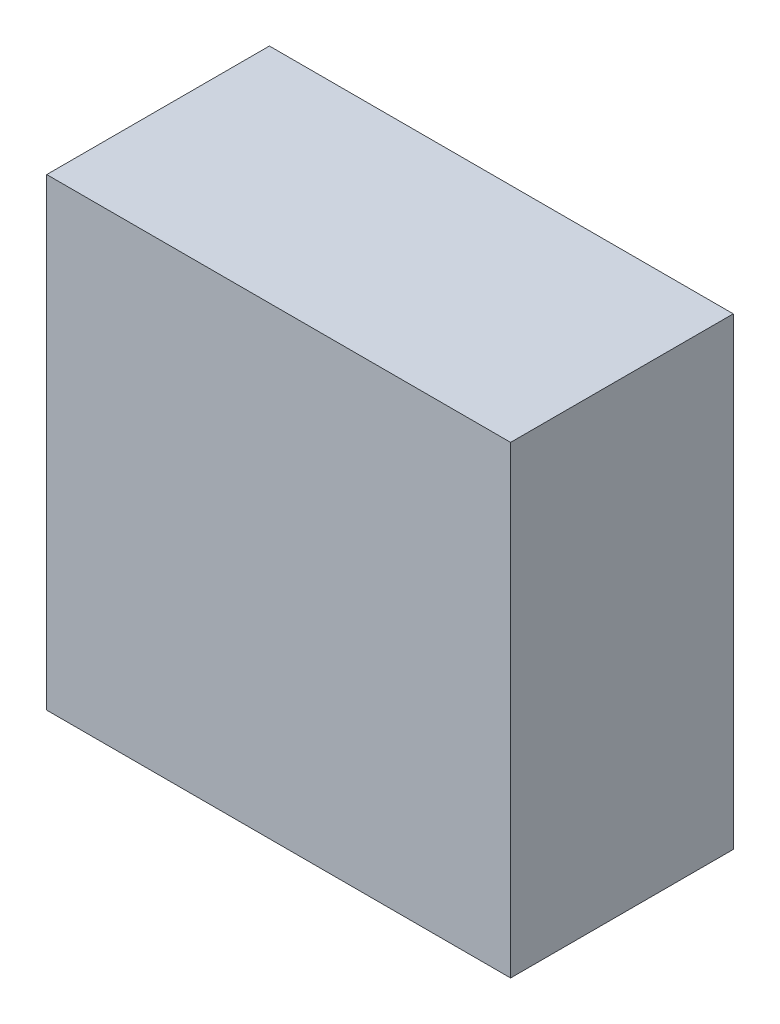
ISO-10303-21;
HEADER;
FILE_DESCRIPTION(('STEP AP214'),'2;1');
FILE_NAME('part.step','',(''),(''),'','','');
FILE_SCHEMA(('AUTOMOTIVE_DESIGN { 1 0 10303 214 1 1 1 1 }'));
ENDSEC;
DATA;
#1=APPLICATION_CONTEXT('core data for automotive mechanical design processes');
#2=APPLICATION_PROTOCOL_DEFINITION('international standard','automotive_design',2000,#1);
#3=PRODUCT_CONTEXT('',#1,'mechanical');
#4=PRODUCT('Part','Part','',(#3));
#5=PRODUCT_RELATED_PRODUCT_CATEGORY('part','',(#4));
#6=PRODUCT_DEFINITION_FORMATION('','',#4);
#7=PRODUCT_DEFINITION_CONTEXT('part definition',#1,'design');
#8=PRODUCT_DEFINITION('design','',#6,#7);
#9=PRODUCT_DEFINITION_SHAPE('','',#8);
#10=(LENGTH_UNIT() NAMED_UNIT(*) SI_UNIT(.MILLI.,.METRE.));
#11=(NAMED_UNIT(*) PLANE_ANGLE_UNIT() SI_UNIT($,.RADIAN.));
#12=(NAMED_UNIT(*) SI_UNIT($,.STERADIAN.) SOLID_ANGLE_UNIT());
#13=UNCERTAINTY_MEASURE_WITH_UNIT(LENGTH_MEASURE(1.E-05),#10,'distance_accuracy_value','');
#14=(GEOMETRIC_REPRESENTATION_CONTEXT(3) GLOBAL_UNCERTAINTY_ASSIGNED_CONTEXT((#13)) GLOBAL_UNIT_ASSIGNED_CONTEXT((#10,
#11,#12)) REPRESENTATION_CONTEXT('',''));
#15=CARTESIAN_POINT('',(0.,0.,0.));
#16=DIRECTION('',(0.,0.,1.));
#17=DIRECTION('',(1.,0.,0.));
#18=AXIS2_PLACEMENT_3D('',#15,#16,#17);
#19=CARTESIAN_POINT('',(116.654385864421,32.3965896745077,6.));
#20=DIRECTION('',(0.,1.,0.));
#21=DIRECTION('',(0.,0.,1.));
#22=AXIS2_PLACEMENT_3D('',#19,#20,#21);
#23=PLANE('',#22);
#24=DIRECTION('',(1.,0.,0.));
#25=VECTOR('',#24,1.);
#26=CARTESIAN_POINT('',(116.654385864421,32.3965896745077,0.));
#27=LINE('',#26,#25);
#28=CARTESIAN_POINT('',(104.154385864421,32.3965896745077,0.));
#29=VERTEX_POINT('',#28);
#30=CARTESIAN_POINT('',(116.654385864421,32.3965896745077,0.));
#31=VERTEX_POINT('',#30);
#32=EDGE_CURVE('E91',#29,#31,#27,.T.);
#33=ORIENTED_EDGE('',*,*,#32,.T.);
#34=DIRECTION('',(0.,0.,-1.));
#35=VECTOR('',#34,1.);
#36=CARTESIAN_POINT('',(116.654385864421,32.3965896745077,6.));
#37=LINE('',#36,#35);
#38=CARTESIAN_POINT('',(116.654385864421,32.3965896745077,6.));
#39=VERTEX_POINT('',#38);
#40=EDGE_CURVE('E45',#39,#31,#37,.T.);
#41=ORIENTED_EDGE('',*,*,#40,.F.);
#42=DIRECTION('',(1.,0.,0.));
#43=VECTOR('',#42,1.);
#44=CARTESIAN_POINT('',(116.654385864421,32.3965896745077,6.));
#45=LINE('',#44,#43);
#46=CARTESIAN_POINT('',(104.154385864421,32.3965896745077,6.));
#47=VERTEX_POINT('',#46);
#48=EDGE_CURVE('E84',#47,#39,#45,.T.);
#49=ORIENTED_EDGE('',*,*,#48,.F.);
#50=DIRECTION('',(0.,0.,-1.));
#51=VECTOR('',#50,1.);
#52=CARTESIAN_POINT('',(104.154385864421,32.3965896745077,6.));
#53=LINE('',#52,#51);
#54=EDGE_CURVE('E11',#47,#29,#53,.T.);
#55=ORIENTED_EDGE('',*,*,#54,.T.);
#56=EDGE_LOOP('',(#33,#41,#49,#55));
#57=FACE_BOUND('',#56,.T.);
#58=ADVANCED_FACE('F37',(#57),#23,.F.);
#59=CARTESIAN_POINT('',(116.654385864421,44.8965896745077,6.));
#60=DIRECTION('',(-1.,0.,0.));
#61=DIRECTION('',(0.,0.,1.));
#62=AXIS2_PLACEMENT_3D('',#59,#60,#61);
#63=PLANE('',#62);
#64=DIRECTION('',(0.,1.,0.));
#65=VECTOR('',#64,1.);
#66=CARTESIAN_POINT('',(116.654385864421,44.8965896745077,0.));
#67=LINE('',#66,#65);
#68=CARTESIAN_POINT('',(116.654385864421,44.8965896745077,0.));
#69=VERTEX_POINT('',#68);
#70=EDGE_CURVE('E71',#31,#69,#67,.T.);
#71=ORIENTED_EDGE('',*,*,#70,.T.);
#72=DIRECTION('',(0.,0.,-1.));
#73=VECTOR('',#72,1.);
#74=CARTESIAN_POINT('',(116.654385864421,44.8965896745077,6.));
#75=LINE('',#74,#73);
#76=CARTESIAN_POINT('',(116.654385864421,44.8965896745077,6.));
#77=VERTEX_POINT('',#76);
#78=EDGE_CURVE('E92',#77,#69,#75,.T.);
#79=ORIENTED_EDGE('',*,*,#78,.F.);
#80=DIRECTION('',(0.,1.,0.));
#81=VECTOR('',#80,1.);
#82=CARTESIAN_POINT('',(116.654385864421,44.8965896745077,6.));
#83=LINE('',#82,#81);
#84=EDGE_CURVE('E88',#39,#77,#83,.T.);
#85=ORIENTED_EDGE('',*,*,#84,.F.);
#86=ORIENTED_EDGE('',*,*,#40,.T.);
#87=EDGE_LOOP('',(#71,#79,#85,#86));
#88=FACE_BOUND('',#87,.T.);
#89=ADVANCED_FACE('F93',(#88),#63,.F.);
#90=CARTESIAN_POINT('',(104.154385864421,44.8965896745077,6.));
#91=DIRECTION('',(0.,-1.,0.));
#92=DIRECTION('',(0.,0.,-1.));
#93=AXIS2_PLACEMENT_3D('',#90,#91,#92);
#94=PLANE('',#93);
#95=DIRECTION('',(-1.,0.,0.));
#96=VECTOR('',#95,1.);
#97=CARTESIAN_POINT('',(104.154385864421,44.8965896745077,0.));
#98=LINE('',#97,#96);
#99=CARTESIAN_POINT('',(104.154385864421,44.8965896745077,0.));
#100=VERTEX_POINT('',#99);
#101=EDGE_CURVE('E78',#69,#100,#98,.T.);
#102=ORIENTED_EDGE('',*,*,#101,.T.);
#103=DIRECTION('',(0.,0.,-1.));
#104=VECTOR('',#103,1.);
#105=CARTESIAN_POINT('',(104.154385864421,44.8965896745077,6.));
#106=LINE('',#105,#104);
#107=CARTESIAN_POINT('',(104.154385864421,44.8965896745077,6.));
#108=VERTEX_POINT('',#107);
#109=EDGE_CURVE('E97',#108,#100,#106,.T.);
#110=ORIENTED_EDGE('',*,*,#109,.F.);
#111=DIRECTION('',(-1.,0.,0.));
#112=VECTOR('',#111,1.);
#113=CARTESIAN_POINT('',(104.154385864421,44.8965896745077,6.));
#114=LINE('',#113,#112);
#115=EDGE_CURVE('E95',#77,#108,#114,.T.);
#116=ORIENTED_EDGE('',*,*,#115,.F.);
#117=ORIENTED_EDGE('',*,*,#78,.T.);
#118=EDGE_LOOP('',(#102,#110,#116,#117));
#119=FACE_BOUND('',#118,.T.);
#120=ADVANCED_FACE('F107',(#119),#94,.F.);
#121=CARTESIAN_POINT('',(104.154385864421,38.6465896745077,6.));
#122=DIRECTION('',(1.,0.,0.));
#123=DIRECTION('',(0.,0.,-1.));
#124=AXIS2_PLACEMENT_3D('',#121,#122,#123);
#125=PLANE('',#124);
#126=DIRECTION('',(0.,-1.,0.));
#127=VECTOR('',#126,1.);
#128=CARTESIAN_POINT('',(104.154385864421,38.6465896745077,0.));
#129=LINE('',#128,#127);
#130=EDGE_CURVE('E104',#100,#29,#129,.T.);
#131=ORIENTED_EDGE('',*,*,#130,.T.);
#132=ORIENTED_EDGE('',*,*,#54,.F.);
#133=DIRECTION('',(0.,-1.,0.));
#134=VECTOR('',#133,1.);
#135=CARTESIAN_POINT('',(104.154385864421,32.3965896745077,6.));
#136=LINE('',#135,#134);
#137=EDGE_CURVE('E53',#108,#47,#136,.T.);
#138=ORIENTED_EDGE('',*,*,#137,.F.);
#139=ORIENTED_EDGE('',*,*,#109,.T.);
#140=EDGE_LOOP('',(#131,#132,#138,#139));
#141=FACE_BOUND('',#140,.T.);
#142=ADVANCED_FACE('F111',(#141),#125,.F.);
#143=CARTESIAN_POINT('',(0.,0.,6.));
#144=DIRECTION('',(0.,0.,-1.));
#145=DIRECTION('',(-1.,0.,0.));
#146=AXIS2_PLACEMENT_3D('',#143,#144,#145);
#147=PLANE('',#146);
#148=ORIENTED_EDGE('',*,*,#137,.T.);
#149=ORIENTED_EDGE('',*,*,#48,.T.);
#150=ORIENTED_EDGE('',*,*,#84,.T.);
#151=ORIENTED_EDGE('',*,*,#115,.T.);
#152=EDGE_LOOP('',(#148,#149,#150,#151));
#153=FACE_BOUND('',#152,.T.);
#154=ADVANCED_FACE('F86',(#153),#147,.F.);
#155=CARTESIAN_POINT('',(0.,0.,0.));
#156=DIRECTION('',(0.,0.,-1.));
#157=DIRECTION('',(-1.,0.,0.));
#158=AXIS2_PLACEMENT_3D('',#155,#156,#157);
#159=PLANE('',#158);
#160=ORIENTED_EDGE('',*,*,#32,.F.);
#161=ORIENTED_EDGE('',*,*,#130,.F.);
#162=ORIENTED_EDGE('',*,*,#101,.F.);
#163=ORIENTED_EDGE('',*,*,#70,.F.);
#164=EDGE_LOOP('',(#160,#161,#162,#163));
#165=FACE_BOUND('',#164,.T.);
#166=ADVANCED_FACE('F110',(#165),#159,.T.);
#167=CLOSED_SHELL('',(#58,#89,#120,#142,#154,#166));
#168=MANIFOLD_SOLID_BREP('B2',#167);
#169=ADVANCED_BREP_SHAPE_REPRESENTATION('',(#18,#168),#14);
#170=SHAPE_DEFINITION_REPRESENTATION(#9,#169);
ENDSEC;
END-ISO-10303-21;
